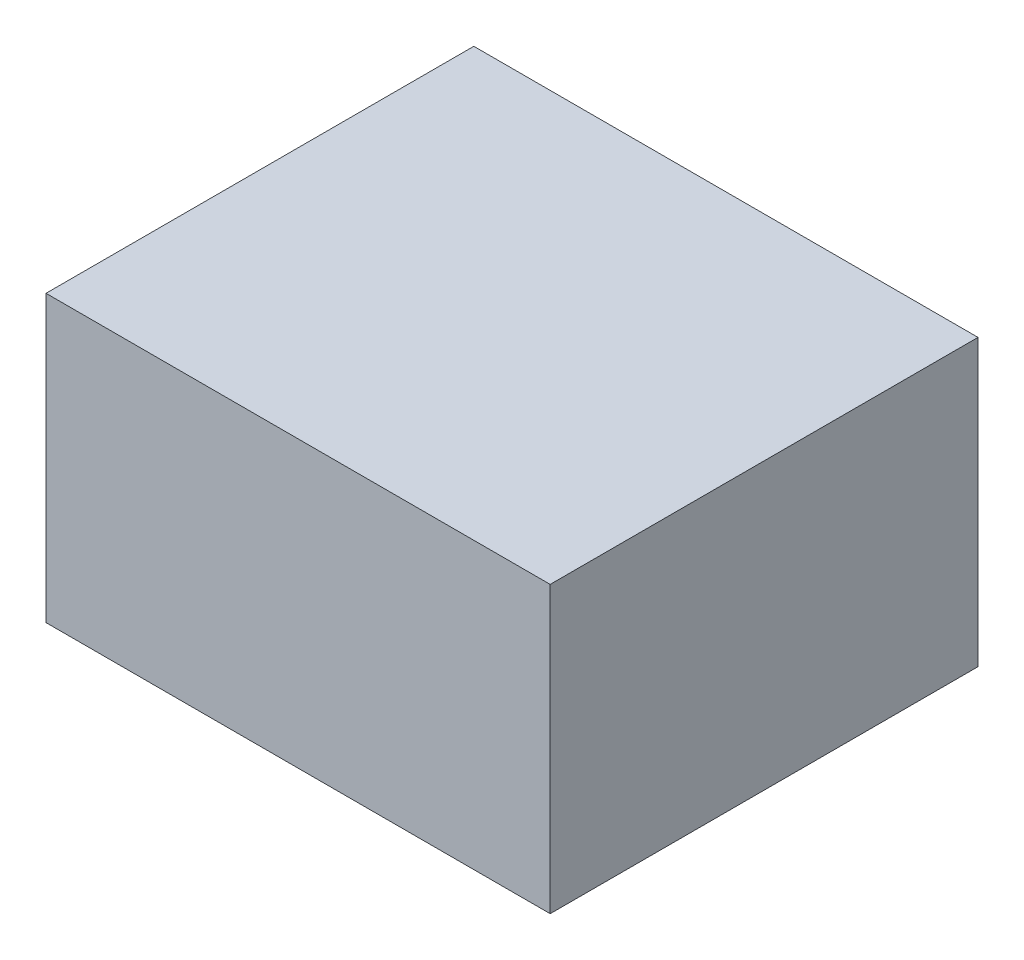
ISO-10303-21;
HEADER;
FILE_DESCRIPTION(('STEP AP214'),'2;1');
FILE_NAME('part.step','',(''),(''),'','','');
FILE_SCHEMA(('AUTOMOTIVE_DESIGN { 1 0 10303 214 1 1 1 1 }'));
ENDSEC;
DATA;
#1=APPLICATION_CONTEXT('core data for automotive mechanical design processes');
#2=APPLICATION_PROTOCOL_DEFINITION('international standard','automotive_design',2000,#1);
#3=PRODUCT_CONTEXT('',#1,'mechanical');
#4=PRODUCT('Part','Part','',(#3));
#5=PRODUCT_RELATED_PRODUCT_CATEGORY('part','',(#4));
#6=PRODUCT_DEFINITION_FORMATION('','',#4);
#7=PRODUCT_DEFINITION_CONTEXT('part definition',#1,'design');
#8=PRODUCT_DEFINITION('design','',#6,#7);
#9=PRODUCT_DEFINITION_SHAPE('','',#8);
#10=(LENGTH_UNIT() NAMED_UNIT(*) SI_UNIT(.MILLI.,.METRE.));
#11=(NAMED_UNIT(*) PLANE_ANGLE_UNIT() SI_UNIT($,.RADIAN.));
#12=(NAMED_UNIT(*) SI_UNIT($,.STERADIAN.) SOLID_ANGLE_UNIT());
#13=UNCERTAINTY_MEASURE_WITH_UNIT(LENGTH_MEASURE(1.E-05),#10,'distance_accuracy_value','');
#14=(GEOMETRIC_REPRESENTATION_CONTEXT(3) GLOBAL_UNCERTAINTY_ASSIGNED_CONTEXT((#13)) GLOBAL_UNIT_ASSIGNED_CONTEXT((#10,
#11,#12)) REPRESENTATION_CONTEXT('',''));
#15=CARTESIAN_POINT('',(0.,0.,0.));
#16=DIRECTION('',(0.,0.,1.));
#17=DIRECTION('',(1.,0.,0.));
#18=AXIS2_PLACEMENT_3D('',#15,#16,#17);
#19=CARTESIAN_POINT('',(0.,0.,4.65));
#20=DIRECTION('',(0.,0.,1.));
#21=DIRECTION('',(1.,0.,0.));
#22=AXIS2_PLACEMENT_3D('',#19,#20,#21);
#23=PLANE('',#22);
#24=DIRECTION('',(1.,0.,0.));
#25=VECTOR('',#24,1.);
#26=CARTESIAN_POINT('',(-2.74,-1.55,4.65));
#27=LINE('',#26,#25);
#28=CARTESIAN_POINT('',(-2.74,-1.55,4.65));
#29=VERTEX_POINT('',#28);
#30=CARTESIAN_POINT('',(2.74,-1.55,4.65));
#31=VERTEX_POINT('',#30);
#32=EDGE_CURVE('E83',#29,#31,#27,.T.);
#33=ORIENTED_EDGE('',*,*,#32,.T.);
#34=DIRECTION('',(0.,1.,0.));
#35=VECTOR('',#34,1.);
#36=CARTESIAN_POINT('',(2.74,-1.55,4.65));
#37=LINE('',#36,#35);
#38=CARTESIAN_POINT('',(2.74,1.55,4.65));
#39=VERTEX_POINT('',#38);
#40=EDGE_CURVE('E107',#31,#39,#37,.T.);
#41=ORIENTED_EDGE('',*,*,#40,.T.);
#42=DIRECTION('',(-1.,0.,0.));
#43=VECTOR('',#42,1.);
#44=CARTESIAN_POINT('',(2.74,1.55,4.65));
#45=LINE('',#44,#43);
#46=CARTESIAN_POINT('',(-2.74,1.55,4.65));
#47=VERTEX_POINT('',#46);
#48=EDGE_CURVE('E75',#39,#47,#45,.T.);
#49=ORIENTED_EDGE('',*,*,#48,.T.);
#50=DIRECTION('',(0.,-1.,0.));
#51=VECTOR('',#50,1.);
#52=CARTESIAN_POINT('',(-2.74,1.55,4.65));
#53=LINE('',#52,#51);
#54=EDGE_CURVE('E11',#47,#29,#53,.T.);
#55=ORIENTED_EDGE('',*,*,#54,.T.);
#56=EDGE_LOOP('',(#33,#41,#49,#55));
#57=FACE_BOUND('',#56,.T.);
#58=ADVANCED_FACE('F17',(#57),#23,.T.);
#59=CARTESIAN_POINT('',(0.,0.,0.));
#60=DIRECTION('',(0.,0.,1.));
#61=DIRECTION('',(1.,0.,0.));
#62=AXIS2_PLACEMENT_3D('',#59,#60,#61);
#63=PLANE('',#62);
#64=DIRECTION('',(0.,-1.,0.));
#65=VECTOR('',#64,1.);
#66=CARTESIAN_POINT('',(-2.74,1.55,0.));
#67=LINE('',#66,#65);
#68=CARTESIAN_POINT('',(-2.74,1.55,0.));
#69=VERTEX_POINT('',#68);
#70=CARTESIAN_POINT('',(-2.74,-1.55,0.));
#71=VERTEX_POINT('',#70);
#72=EDGE_CURVE('E26',#69,#71,#67,.T.);
#73=ORIENTED_EDGE('',*,*,#72,.F.);
#74=DIRECTION('',(-1.,0.,0.));
#75=VECTOR('',#74,1.);
#76=CARTESIAN_POINT('',(2.74,1.55,0.));
#77=LINE('',#76,#75);
#78=CARTESIAN_POINT('',(2.74,1.55,0.));
#79=VERTEX_POINT('',#78);
#80=EDGE_CURVE('E110',#79,#69,#77,.T.);
#81=ORIENTED_EDGE('',*,*,#80,.F.);
#82=DIRECTION('',(0.,1.,0.));
#83=VECTOR('',#82,1.);
#84=CARTESIAN_POINT('',(2.74,-1.55,0.));
#85=LINE('',#84,#83);
#86=CARTESIAN_POINT('',(2.74,-1.55,0.));
#87=VERTEX_POINT('',#86);
#88=EDGE_CURVE('E85',#87,#79,#85,.T.);
#89=ORIENTED_EDGE('',*,*,#88,.F.);
#90=DIRECTION('',(1.,0.,0.));
#91=VECTOR('',#90,1.);
#92=CARTESIAN_POINT('',(-2.74,-1.55,0.));
#93=LINE('',#92,#91);
#94=EDGE_CURVE('E81',#71,#87,#93,.T.);
#95=ORIENTED_EDGE('',*,*,#94,.F.);
#96=EDGE_LOOP('',(#73,#81,#89,#95));
#97=FACE_BOUND('',#96,.T.);
#98=ADVANCED_FACE('F87',(#97),#63,.F.);
#99=CARTESIAN_POINT('',(-2.74,1.55,0.));
#100=DIRECTION('',(1.,0.,0.));
#101=DIRECTION('',(0.,1.,0.));
#102=AXIS2_PLACEMENT_3D('',#99,#100,#101);
#103=PLANE('',#102);
#104=ORIENTED_EDGE('',*,*,#72,.T.);
#105=DIRECTION('',(0.,0.,1.));
#106=VECTOR('',#105,1.);
#107=CARTESIAN_POINT('',(-2.74,-1.55,0.));
#108=LINE('',#107,#106);
#109=EDGE_CURVE('E70',#71,#29,#108,.T.);
#110=ORIENTED_EDGE('',*,*,#109,.T.);
#111=ORIENTED_EDGE('',*,*,#54,.F.);
#112=DIRECTION('',(0.,0.,1.));
#113=VECTOR('',#112,1.);
#114=CARTESIAN_POINT('',(-2.74,1.55,0.));
#115=LINE('',#114,#113);
#116=EDGE_CURVE('E20',#69,#47,#115,.T.);
#117=ORIENTED_EDGE('',*,*,#116,.F.);
#118=EDGE_LOOP('',(#104,#110,#111,#117));
#119=FACE_BOUND('',#118,.T.);
#120=ADVANCED_FACE('F69',(#119),#103,.F.);
#121=CARTESIAN_POINT('',(2.74,1.55,0.));
#122=DIRECTION('',(0.,-1.,0.));
#123=DIRECTION('',(0.,0.,-1.));
#124=AXIS2_PLACEMENT_3D('',#121,#122,#123);
#125=PLANE('',#124);
#126=ORIENTED_EDGE('',*,*,#80,.T.);
#127=ORIENTED_EDGE('',*,*,#116,.T.);
#128=ORIENTED_EDGE('',*,*,#48,.F.);
#129=DIRECTION('',(0.,0.,1.));
#130=VECTOR('',#129,1.);
#131=CARTESIAN_POINT('',(2.74,1.55,0.));
#132=LINE('',#131,#130);
#133=EDGE_CURVE('E103',#79,#39,#132,.T.);
#134=ORIENTED_EDGE('',*,*,#133,.F.);
#135=EDGE_LOOP('',(#126,#127,#128,#134));
#136=FACE_BOUND('',#135,.T.);
#137=ADVANCED_FACE('F123',(#136),#125,.F.);
#138=CARTESIAN_POINT('',(2.74,-1.55,0.));
#139=DIRECTION('',(-1.,0.,0.));
#140=DIRECTION('',(0.,0.,1.));
#141=AXIS2_PLACEMENT_3D('',#138,#139,#140);
#142=PLANE('',#141);
#143=ORIENTED_EDGE('',*,*,#88,.T.);
#144=ORIENTED_EDGE('',*,*,#133,.T.);
#145=ORIENTED_EDGE('',*,*,#40,.F.);
#146=DIRECTION('',(0.,0.,1.));
#147=VECTOR('',#146,1.);
#148=CARTESIAN_POINT('',(2.74,-1.55,0.));
#149=LINE('',#148,#147);
#150=EDGE_CURVE('E91',#87,#31,#149,.T.);
#151=ORIENTED_EDGE('',*,*,#150,.F.);
#152=EDGE_LOOP('',(#143,#144,#145,#151));
#153=FACE_BOUND('',#152,.T.);
#154=ADVANCED_FACE('F125',(#153),#142,.F.);
#155=CARTESIAN_POINT('',(-2.74,-1.55,0.));
#156=DIRECTION('',(0.,1.,0.));
#157=DIRECTION('',(1.,0.,0.));
#158=AXIS2_PLACEMENT_3D('',#155,#156,#157);
#159=PLANE('',#158);
#160=ORIENTED_EDGE('',*,*,#94,.T.);
#161=ORIENTED_EDGE('',*,*,#150,.T.);
#162=ORIENTED_EDGE('',*,*,#32,.F.);
#163=ORIENTED_EDGE('',*,*,#109,.F.);
#164=EDGE_LOOP('',(#160,#161,#162,#163));
#165=FACE_BOUND('',#164,.T.);
#166=ADVANCED_FACE('F79',(#165),#159,.F.);
#167=CLOSED_SHELL('',(#58,#98,#120,#137,#154,#166));
#168=MANIFOLD_SOLID_BREP('B1',#167);
#169=ADVANCED_BREP_SHAPE_REPRESENTATION('',(#18,#168),#14);
#170=SHAPE_DEFINITION_REPRESENTATION(#9,#169);
ENDSEC;
END-ISO-10303-21;
